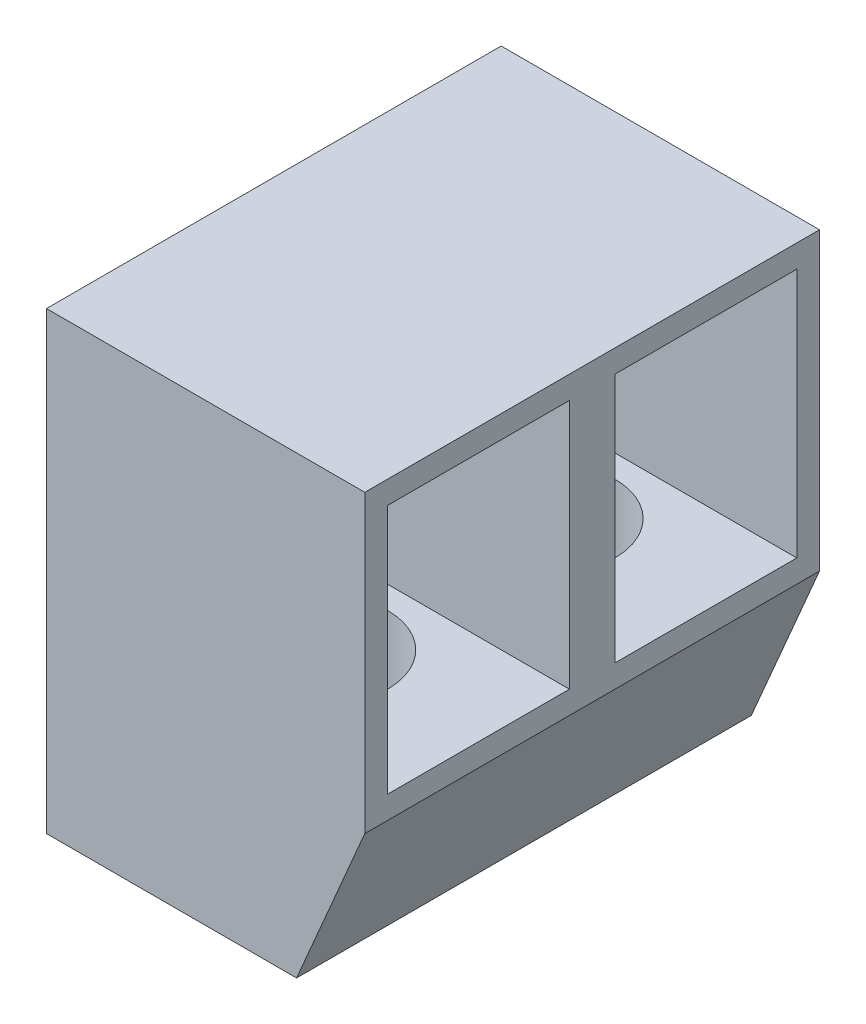
ISO-10303-21;
HEADER;
FILE_DESCRIPTION(('STEP AP214'),'2;1');
FILE_NAME('part.step','',(''),(''),'','','');
FILE_SCHEMA(('AUTOMOTIVE_DESIGN { 1 0 10303 214 1 1 1 1 }'));
ENDSEC;
DATA;
#1=APPLICATION_CONTEXT('core data for automotive mechanical design processes');
#2=APPLICATION_PROTOCOL_DEFINITION('international standard','automotive_design',2000,#1);
#3=PRODUCT_CONTEXT('',#1,'mechanical');
#4=PRODUCT('Part','Part','',(#3));
#5=PRODUCT_RELATED_PRODUCT_CATEGORY('part','',(#4));
#6=PRODUCT_DEFINITION_FORMATION('','',#4);
#7=PRODUCT_DEFINITION_CONTEXT('part definition',#1,'design');
#8=PRODUCT_DEFINITION('design','',#6,#7);
#9=PRODUCT_DEFINITION_SHAPE('','',#8);
#10=(LENGTH_UNIT() NAMED_UNIT(*) SI_UNIT(.MILLI.,.METRE.));
#11=(NAMED_UNIT(*) PLANE_ANGLE_UNIT() SI_UNIT($,.RADIAN.));
#12=(NAMED_UNIT(*) SI_UNIT($,.STERADIAN.) SOLID_ANGLE_UNIT());
#13=UNCERTAINTY_MEASURE_WITH_UNIT(LENGTH_MEASURE(1.E-05),#10,'distance_accuracy_value','');
#14=(GEOMETRIC_REPRESENTATION_CONTEXT(3) GLOBAL_UNCERTAINTY_ASSIGNED_CONTEXT((#13)) GLOBAL_UNIT_ASSIGNED_CONTEXT((#10,
#11,#12)) REPRESENTATION_CONTEXT('',''));
#15=CARTESIAN_POINT('',(0.,0.,0.));
#16=DIRECTION('',(0.,0.,1.));
#17=DIRECTION('',(1.,0.,0.));
#18=AXIS2_PLACEMENT_3D('',#15,#16,#17);
#19=CARTESIAN_POINT('',(5.5,0.,10.));
#20=DIRECTION('',(0.,1.,0.));
#21=DIRECTION('',(-1.,0.,0.));
#22=AXIS2_PLACEMENT_3D('',#19,#20,#21);
#23=PLANE('',#22);
#24=CARTESIAN_POINT('',(3.5,0.,7.5));
#25=DIRECTION('',(0.,1.,0.));
#26=DIRECTION('',(-1.,0.,0.));
#27=AXIS2_PLACEMENT_3D('',#24,#25,#26);
#28=CIRCLE('',#27,1.5);
#29=CARTESIAN_POINT('',(2.,0.,7.5));
#30=VERTEX_POINT('',#29);
#31=EDGE_CURVE('E257',#30,#30,#28,.F.);
#32=ORIENTED_EDGE('',*,*,#31,.F.);
#33=EDGE_LOOP('',(#32));
#34=FACE_BOUND('',#33,.T.);
#35=CARTESIAN_POINT('',(3.5,0.,2.5));
#36=DIRECTION('',(0.,1.,0.));
#37=DIRECTION('',(-1.,0.,0.));
#38=AXIS2_PLACEMENT_3D('',#35,#36,#37);
#39=CIRCLE('',#38,1.5);
#40=CARTESIAN_POINT('',(2.,0.,2.5));
#41=VERTEX_POINT('',#40);
#42=EDGE_CURVE('E260',#41,#41,#39,.F.);
#43=ORIENTED_EDGE('',*,*,#42,.F.);
#44=EDGE_LOOP('',(#43));
#45=FACE_BOUND('',#44,.T.);
#46=DIRECTION('',(1.,0.,0.));
#47=VECTOR('',#46,1.);
#48=CARTESIAN_POINT('',(5.5,0.,0.));
#49=LINE('',#48,#47);
#50=CARTESIAN_POINT('',(0.,0.,0.));
#51=VERTEX_POINT('',#50);
#52=CARTESIAN_POINT('',(5.5,0.,0.));
#53=VERTEX_POINT('',#52);
#54=EDGE_CURVE('E193',#51,#53,#49,.T.);
#55=ORIENTED_EDGE('',*,*,#54,.T.);
#56=DIRECTION('',(0.,0.,-1.));
#57=VECTOR('',#56,1.);
#58=CARTESIAN_POINT('',(5.5,0.,10.));
#59=LINE('',#58,#57);
#60=CARTESIAN_POINT('',(5.5,0.,10.));
#61=VERTEX_POINT('',#60);
#62=EDGE_CURVE('E11',#61,#53,#59,.T.);
#63=ORIENTED_EDGE('',*,*,#62,.F.);
#64=DIRECTION('',(1.,0.,0.));
#65=VECTOR('',#64,1.);
#66=CARTESIAN_POINT('',(5.5,0.,10.));
#67=LINE('',#66,#65);
#68=CARTESIAN_POINT('',(0.,0.,10.));
#69=VERTEX_POINT('',#68);
#70=EDGE_CURVE('E194',#69,#61,#67,.T.);
#71=ORIENTED_EDGE('',*,*,#70,.F.);
#72=DIRECTION('',(0.,0.,-1.));
#73=VECTOR('',#72,1.);
#74=CARTESIAN_POINT('',(0.,0.,10.));
#75=LINE('',#74,#73);
#76=EDGE_CURVE('E206',#69,#51,#75,.T.);
#77=ORIENTED_EDGE('',*,*,#76,.T.);
#78=EDGE_LOOP('',(#55,#63,#71,#77));
#79=FACE_BOUND('',#78,.T.);
#80=ADVANCED_FACE('F32',(#34,#45,#79),#23,.F.);
#81=CARTESIAN_POINT('',(7.,3.5,10.));
#82=DIRECTION('',(-0.919145030018058,0.393919298579168,0.));
#83=DIRECTION('',(-0.393919298579168,-0.919145030018058,0.));
#84=AXIS2_PLACEMENT_3D('',#81,#82,#83);
#85=PLANE('',#84);
#86=DIRECTION('',(0.393919298579168,0.919145030018058,0.));
#87=VECTOR('',#86,1.);
#88=CARTESIAN_POINT('',(7.,3.5,0.));
#89=LINE('',#88,#87);
#90=CARTESIAN_POINT('',(7.,3.5,0.));
#91=VERTEX_POINT('',#90);
#92=EDGE_CURVE('E209',#53,#91,#89,.T.);
#93=ORIENTED_EDGE('',*,*,#92,.T.);
#94=DIRECTION('',(0.,0.,-1.));
#95=VECTOR('',#94,1.);
#96=CARTESIAN_POINT('',(7.,3.5,10.));
#97=LINE('',#96,#95);
#98=CARTESIAN_POINT('',(7.,3.5,10.));
#99=VERTEX_POINT('',#98);
#100=EDGE_CURVE('E39',#99,#91,#97,.T.);
#101=ORIENTED_EDGE('',*,*,#100,.F.);
#102=DIRECTION('',(0.393919298579168,0.919145030018058,0.));
#103=VECTOR('',#102,1.);
#104=CARTESIAN_POINT('',(7.,3.5,10.));
#105=LINE('',#104,#103);
#106=EDGE_CURVE('E197',#61,#99,#105,.T.);
#107=ORIENTED_EDGE('',*,*,#106,.F.);
#108=ORIENTED_EDGE('',*,*,#62,.T.);
#109=EDGE_LOOP('',(#93,#101,#107,#108));
#110=FACE_BOUND('',#109,.T.);
#111=ADVANCED_FACE('F247',(#110),#85,.F.);
#112=CARTESIAN_POINT('',(7.,10.,10.));
#113=DIRECTION('',(-1.,0.,0.));
#114=DIRECTION('',(0.,-1.,0.));
#115=AXIS2_PLACEMENT_3D('',#112,#113,#114);
#116=PLANE('',#115);
#117=DIRECTION('',(0.,0.,-1.));
#118=VECTOR('',#117,1.);
#119=CARTESIAN_POINT('',(7.,4.,4.5));
#120=LINE('',#119,#118);
#121=CARTESIAN_POINT('',(7.,4.,4.5));
#122=VERTEX_POINT('',#121);
#123=CARTESIAN_POINT('',(7.,4.,0.5));
#124=VERTEX_POINT('',#123);
#125=EDGE_CURVE('E148',#122,#124,#120,.T.);
#126=ORIENTED_EDGE('',*,*,#125,.F.);
#127=DIRECTION('',(0.,-1.,0.));
#128=VECTOR('',#127,1.);
#129=CARTESIAN_POINT('',(7.,9.5,4.5));
#130=LINE('',#129,#128);
#131=CARTESIAN_POINT('',(7.,9.5,4.5));
#132=VERTEX_POINT('',#131);
#133=EDGE_CURVE('E46',#132,#122,#130,.T.);
#134=ORIENTED_EDGE('',*,*,#133,.F.);
#135=DIRECTION('',(0.,0.,1.));
#136=VECTOR('',#135,1.);
#137=CARTESIAN_POINT('',(7.,9.5,4.5));
#138=LINE('',#137,#136);
#139=CARTESIAN_POINT('',(7.,9.5,0.5));
#140=VERTEX_POINT('',#139);
#141=EDGE_CURVE('E134',#140,#132,#138,.T.);
#142=ORIENTED_EDGE('',*,*,#141,.F.);
#143=DIRECTION('',(0.,1.,0.));
#144=VECTOR('',#143,1.);
#145=CARTESIAN_POINT('',(7.,9.5,0.5));
#146=LINE('',#145,#144);
#147=EDGE_CURVE('E154',#124,#140,#146,.T.);
#148=ORIENTED_EDGE('',*,*,#147,.F.);
#149=EDGE_LOOP('',(#126,#134,#142,#148));
#150=FACE_BOUND('',#149,.T.);
#151=DIRECTION('',(0.,0.,-1.));
#152=VECTOR('',#151,1.);
#153=CARTESIAN_POINT('',(7.,4.,9.5));
#154=LINE('',#153,#152);
#155=CARTESIAN_POINT('',(7.,4.,9.5));
#156=VERTEX_POINT('',#155);
#157=CARTESIAN_POINT('',(7.,4.,5.5));
#158=VERTEX_POINT('',#157);
#159=EDGE_CURVE('E172',#156,#158,#154,.T.);
#160=ORIENTED_EDGE('',*,*,#159,.F.);
#161=DIRECTION('',(0.,-1.,0.));
#162=VECTOR('',#161,1.);
#163=CARTESIAN_POINT('',(7.,9.5,9.5));
#164=LINE('',#163,#162);
#165=CARTESIAN_POINT('',(7.,9.5,9.5));
#166=VERTEX_POINT('',#165);
#167=EDGE_CURVE('E170',#166,#156,#164,.T.);
#168=ORIENTED_EDGE('',*,*,#167,.F.);
#169=DIRECTION('',(0.,0.,1.));
#170=VECTOR('',#169,1.);
#171=CARTESIAN_POINT('',(7.,9.5,9.5));
#172=LINE('',#171,#170);
#173=CARTESIAN_POINT('',(7.,9.5,5.5));
#174=VERTEX_POINT('',#173);
#175=EDGE_CURVE('E178',#174,#166,#172,.T.);
#176=ORIENTED_EDGE('',*,*,#175,.F.);
#177=DIRECTION('',(0.,1.,0.));
#178=VECTOR('',#177,1.);
#179=CARTESIAN_POINT('',(7.,9.5,5.5));
#180=LINE('',#179,#178);
#181=EDGE_CURVE('E175',#158,#174,#180,.T.);
#182=ORIENTED_EDGE('',*,*,#181,.F.);
#183=EDGE_LOOP('',(#160,#168,#176,#182));
#184=FACE_BOUND('',#183,.T.);
#185=DIRECTION('',(0.,1.,0.));
#186=VECTOR('',#185,1.);
#187=CARTESIAN_POINT('',(7.,10.,0.));
#188=LINE('',#187,#186);
#189=CARTESIAN_POINT('',(7.,10.,0.));
#190=VERTEX_POINT('',#189);
#191=EDGE_CURVE('E211',#91,#190,#188,.T.);
#192=ORIENTED_EDGE('',*,*,#191,.T.);
#193=DIRECTION('',(0.,0.,-1.));
#194=VECTOR('',#193,1.);
#195=CARTESIAN_POINT('',(7.,10.,10.));
#196=LINE('',#195,#194);
#197=CARTESIAN_POINT('',(7.,10.,10.));
#198=VERTEX_POINT('',#197);
#199=EDGE_CURVE('E221',#198,#190,#196,.T.);
#200=ORIENTED_EDGE('',*,*,#199,.F.);
#201=DIRECTION('',(0.,1.,0.));
#202=VECTOR('',#201,1.);
#203=CARTESIAN_POINT('',(7.,10.,10.));
#204=LINE('',#203,#202);
#205=EDGE_CURVE('E200',#99,#198,#204,.T.);
#206=ORIENTED_EDGE('',*,*,#205,.F.);
#207=ORIENTED_EDGE('',*,*,#100,.T.);
#208=EDGE_LOOP('',(#192,#200,#206,#207));
#209=FACE_BOUND('',#208,.T.);
#210=ADVANCED_FACE('F228',(#150,#184,#209),#116,.F.);
#211=CARTESIAN_POINT('',(0.,10.,10.));
#212=DIRECTION('',(0.,-1.,0.));
#213=DIRECTION('',(0.,0.,-1.));
#214=AXIS2_PLACEMENT_3D('',#211,#212,#213);
#215=PLANE('',#214);
#216=DIRECTION('',(-1.,0.,0.));
#217=VECTOR('',#216,1.);
#218=CARTESIAN_POINT('',(0.,10.,0.));
#219=LINE('',#218,#217);
#220=CARTESIAN_POINT('',(0.,10.,0.));
#221=VERTEX_POINT('',#220);
#222=EDGE_CURVE('E213',#190,#221,#219,.T.);
#223=ORIENTED_EDGE('',*,*,#222,.T.);
#224=DIRECTION('',(0.,0.,-1.));
#225=VECTOR('',#224,1.);
#226=CARTESIAN_POINT('',(0.,10.,10.));
#227=LINE('',#226,#225);
#228=CARTESIAN_POINT('',(0.,10.,10.));
#229=VERTEX_POINT('',#228);
#230=EDGE_CURVE('E218',#229,#221,#227,.T.);
#231=ORIENTED_EDGE('',*,*,#230,.F.);
#232=DIRECTION('',(-1.,0.,0.));
#233=VECTOR('',#232,1.);
#234=CARTESIAN_POINT('',(0.,10.,10.));
#235=LINE('',#234,#233);
#236=EDGE_CURVE('E202',#198,#229,#235,.T.);
#237=ORIENTED_EDGE('',*,*,#236,.F.);
#238=ORIENTED_EDGE('',*,*,#199,.T.);
#239=EDGE_LOOP('',(#223,#231,#237,#238));
#240=FACE_BOUND('',#239,.T.);
#241=ADVANCED_FACE('F238',(#240),#215,.F.);
#242=CARTESIAN_POINT('',(0.,0.,10.));
#243=DIRECTION('',(1.,0.,0.));
#244=DIRECTION('',(0.,0.,-1.));
#245=AXIS2_PLACEMENT_3D('',#242,#243,#244);
#246=PLANE('',#245);
#247=DIRECTION('',(0.,0.,-1.));
#248=VECTOR('',#247,1.);
#249=CARTESIAN_POINT('',(0.,9.5,4.5));
#250=LINE('',#249,#248);
#251=CARTESIAN_POINT('',(0.,9.5,4.5));
#252=VERTEX_POINT('',#251);
#253=CARTESIAN_POINT('',(0.,9.5,0.5));
#254=VERTEX_POINT('',#253);
#255=EDGE_CURVE('E146',#252,#254,#250,.T.);
#256=ORIENTED_EDGE('',*,*,#255,.F.);
#257=DIRECTION('',(0.,1.,0.));
#258=VECTOR('',#257,1.);
#259=CARTESIAN_POINT('',(0.,9.5,4.5));
#260=LINE('',#259,#258);
#261=CARTESIAN_POINT('',(0.,4.,4.5));
#262=VERTEX_POINT('',#261);
#263=EDGE_CURVE('E128',#262,#252,#260,.T.);
#264=ORIENTED_EDGE('',*,*,#263,.F.);
#265=DIRECTION('',(0.,0.,1.));
#266=VECTOR('',#265,1.);
#267=CARTESIAN_POINT('',(0.,4.,4.5));
#268=LINE('',#267,#266);
#269=CARTESIAN_POINT('',(0.,4.,0.499999999999999));
#270=VERTEX_POINT('',#269);
#271=EDGE_CURVE('E137',#270,#262,#268,.T.);
#272=ORIENTED_EDGE('',*,*,#271,.F.);
#273=DIRECTION('',(0.,-1.,0.));
#274=VECTOR('',#273,1.);
#275=CARTESIAN_POINT('',(0.,9.5,0.5));
#276=LINE('',#275,#274);
#277=EDGE_CURVE('E54',#254,#270,#276,.T.);
#278=ORIENTED_EDGE('',*,*,#277,.F.);
#279=EDGE_LOOP('',(#256,#264,#272,#278));
#280=FACE_BOUND('',#279,.T.);
#281=DIRECTION('',(0.,0.,-1.));
#282=VECTOR('',#281,1.);
#283=CARTESIAN_POINT('',(0.,9.5,9.5));
#284=LINE('',#283,#282);
#285=CARTESIAN_POINT('',(0.,9.5,9.5));
#286=VERTEX_POINT('',#285);
#287=CARTESIAN_POINT('',(0.,9.5,5.5));
#288=VERTEX_POINT('',#287);
#289=EDGE_CURVE('E164',#286,#288,#284,.T.);
#290=ORIENTED_EDGE('',*,*,#289,.F.);
#291=DIRECTION('',(0.,1.,0.));
#292=VECTOR('',#291,1.);
#293=CARTESIAN_POINT('',(0.,9.5,9.5));
#294=LINE('',#293,#292);
#295=CARTESIAN_POINT('',(0.,4.,9.5));
#296=VERTEX_POINT('',#295);
#297=EDGE_CURVE('E167',#296,#286,#294,.T.);
#298=ORIENTED_EDGE('',*,*,#297,.F.);
#299=DIRECTION('',(0.,0.,1.));
#300=VECTOR('',#299,1.);
#301=CARTESIAN_POINT('',(0.,4.,9.5));
#302=LINE('',#301,#300);
#303=CARTESIAN_POINT('',(0.,4.,5.5));
#304=VERTEX_POINT('',#303);
#305=EDGE_CURVE('E184',#304,#296,#302,.T.);
#306=ORIENTED_EDGE('',*,*,#305,.F.);
#307=DIRECTION('',(0.,-1.,0.));
#308=VECTOR('',#307,1.);
#309=CARTESIAN_POINT('',(0.,9.5,5.5));
#310=LINE('',#309,#308);
#311=EDGE_CURVE('E140',#288,#304,#310,.T.);
#312=ORIENTED_EDGE('',*,*,#311,.F.);
#313=EDGE_LOOP('',(#290,#298,#306,#312));
#314=FACE_BOUND('',#313,.T.);
#315=DIRECTION('',(0.,-1.,0.));
#316=VECTOR('',#315,1.);
#317=CARTESIAN_POINT('',(0.,0.,0.));
#318=LINE('',#317,#316);
#319=EDGE_CURVE('E198',#221,#51,#318,.T.);
#320=ORIENTED_EDGE('',*,*,#319,.T.);
#321=ORIENTED_EDGE('',*,*,#76,.F.);
#322=DIRECTION('',(0.,-1.,0.));
#323=VECTOR('',#322,1.);
#324=CARTESIAN_POINT('',(0.,0.,10.));
#325=LINE('',#324,#323);
#326=EDGE_CURVE('E204',#229,#69,#325,.T.);
#327=ORIENTED_EDGE('',*,*,#326,.F.);
#328=ORIENTED_EDGE('',*,*,#230,.T.);
#329=EDGE_LOOP('',(#320,#321,#327,#328));
#330=FACE_BOUND('',#329,.T.);
#331=ADVANCED_FACE('F143',(#280,#314,#330),#246,.F.);
#332=CARTESIAN_POINT('',(0.,0.,10.));
#333=DIRECTION('',(0.,0.,-1.));
#334=DIRECTION('',(-1.,0.,0.));
#335=AXIS2_PLACEMENT_3D('',#332,#333,#334);
#336=PLANE('',#335);
#337=ORIENTED_EDGE('',*,*,#70,.T.);
#338=ORIENTED_EDGE('',*,*,#106,.T.);
#339=ORIENTED_EDGE('',*,*,#205,.T.);
#340=ORIENTED_EDGE('',*,*,#236,.T.);
#341=ORIENTED_EDGE('',*,*,#326,.T.);
#342=EDGE_LOOP('',(#337,#338,#339,#340,#341));
#343=FACE_BOUND('',#342,.T.);
#344=ADVANCED_FACE('F245',(#343),#336,.F.);
#345=CARTESIAN_POINT('',(0.,0.,0.));
#346=DIRECTION('',(0.,0.,-1.));
#347=DIRECTION('',(-1.,0.,0.));
#348=AXIS2_PLACEMENT_3D('',#345,#346,#347);
#349=PLANE('',#348);
#350=ORIENTED_EDGE('',*,*,#54,.F.);
#351=ORIENTED_EDGE('',*,*,#319,.F.);
#352=ORIENTED_EDGE('',*,*,#222,.F.);
#353=ORIENTED_EDGE('',*,*,#191,.F.);
#354=ORIENTED_EDGE('',*,*,#92,.F.);
#355=EDGE_LOOP('',(#350,#351,#352,#353,#354));
#356=FACE_BOUND('',#355,.T.);
#357=ADVANCED_FACE('F234',(#356),#349,.T.);
#358=CARTESIAN_POINT('',(-0.001000000000001,9.5,9.5));
#359=DIRECTION('',(0.,0.,1.));
#360=DIRECTION('',(1.,0.,0.));
#361=AXIS2_PLACEMENT_3D('',#358,#359,#360);
#362=PLANE('',#361);
#363=ORIENTED_EDGE('',*,*,#297,.T.);
#364=DIRECTION('',(1.,0.,0.));
#365=VECTOR('',#364,1.);
#366=CARTESIAN_POINT('',(-0.001000000000001,9.5,9.5));
#367=LINE('',#366,#365);
#368=EDGE_CURVE('E182',#286,#166,#367,.T.);
#369=ORIENTED_EDGE('',*,*,#368,.T.);
#370=ORIENTED_EDGE('',*,*,#167,.T.);
#371=DIRECTION('',(1.,0.,0.));
#372=VECTOR('',#371,1.);
#373=CARTESIAN_POINT('',(-0.001000000000001,4.,9.5));
#374=LINE('',#373,#372);
#375=EDGE_CURVE('E181',#296,#156,#374,.T.);
#376=ORIENTED_EDGE('',*,*,#375,.F.);
#377=EDGE_LOOP('',(#363,#369,#370,#376));
#378=FACE_BOUND('',#377,.T.);
#379=ADVANCED_FACE('F287',(#378),#362,.F.);
#380=CARTESIAN_POINT('',(-0.001000000000001,9.5,9.5));
#381=DIRECTION('',(0.,1.,0.));
#382=DIRECTION('',(-1.,0.,0.));
#383=AXIS2_PLACEMENT_3D('',#380,#381,#382);
#384=PLANE('',#383);
#385=ORIENTED_EDGE('',*,*,#289,.T.);
#386=DIRECTION('',(1.,0.,0.));
#387=VECTOR('',#386,1.);
#388=CARTESIAN_POINT('',(-0.001000000000001,9.5,5.5));
#389=LINE('',#388,#387);
#390=EDGE_CURVE('E185',#288,#174,#389,.T.);
#391=ORIENTED_EDGE('',*,*,#390,.T.);
#392=ORIENTED_EDGE('',*,*,#175,.T.);
#393=ORIENTED_EDGE('',*,*,#368,.F.);
#394=EDGE_LOOP('',(#385,#391,#392,#393));
#395=FACE_BOUND('',#394,.T.);
#396=ADVANCED_FACE('F294',(#395),#384,.F.);
#397=CARTESIAN_POINT('',(-0.001000000000001,9.5,5.5));
#398=DIRECTION('',(0.,0.,-1.));
#399=DIRECTION('',(-1.,0.,0.));
#400=AXIS2_PLACEMENT_3D('',#397,#398,#399);
#401=PLANE('',#400);
#402=ORIENTED_EDGE('',*,*,#311,.T.);
#403=DIRECTION('',(1.,0.,0.));
#404=VECTOR('',#403,1.);
#405=CARTESIAN_POINT('',(-0.001000000000001,4.,5.5));
#406=LINE('',#405,#404);
#407=EDGE_CURVE('E187',#304,#158,#406,.T.);
#408=ORIENTED_EDGE('',*,*,#407,.T.);
#409=ORIENTED_EDGE('',*,*,#181,.T.);
#410=ORIENTED_EDGE('',*,*,#390,.F.);
#411=EDGE_LOOP('',(#402,#408,#409,#410));
#412=FACE_BOUND('',#411,.T.);
#413=ADVANCED_FACE('F278',(#412),#401,.F.);
#414=CARTESIAN_POINT('',(-0.001000000000001,4.,9.5));
#415=DIRECTION('',(0.,-1.,0.));
#416=DIRECTION('',(1.,0.,0.));
#417=AXIS2_PLACEMENT_3D('',#414,#415,#416);
#418=PLANE('',#417);
#419=CARTESIAN_POINT('',(3.5,4.,7.5));
#420=DIRECTION('',(0.,1.,0.));
#421=DIRECTION('',(-1.,0.,0.));
#422=AXIS2_PLACEMENT_3D('',#419,#420,#421);
#423=CIRCLE('',#422,1.5);
#424=CARTESIAN_POINT('',(2.,4.,7.5));
#425=VERTEX_POINT('',#424);
#426=EDGE_CURVE('E268',#425,#425,#423,.T.);
#427=ORIENTED_EDGE('',*,*,#426,.F.);
#428=EDGE_LOOP('',(#427));
#429=FACE_BOUND('',#428,.T.);
#430=ORIENTED_EDGE('',*,*,#305,.T.);
#431=ORIENTED_EDGE('',*,*,#375,.T.);
#432=ORIENTED_EDGE('',*,*,#159,.T.);
#433=ORIENTED_EDGE('',*,*,#407,.F.);
#434=EDGE_LOOP('',(#430,#431,#432,#433));
#435=FACE_BOUND('',#434,.T.);
#436=ADVANCED_FACE('F275',(#429,#435),#418,.F.);
#437=CARTESIAN_POINT('',(-0.001000000000001,9.5,4.5));
#438=DIRECTION('',(0.,0.,1.));
#439=DIRECTION('',(1.,0.,0.));
#440=AXIS2_PLACEMENT_3D('',#437,#438,#439);
#441=PLANE('',#440);
#442=ORIENTED_EDGE('',*,*,#263,.T.);
#443=DIRECTION('',(1.,0.,0.));
#444=VECTOR('',#443,1.);
#445=CARTESIAN_POINT('',(-0.001000000000001,9.5,4.5));
#446=LINE('',#445,#444);
#447=EDGE_CURVE('E141',#252,#132,#446,.T.);
#448=ORIENTED_EDGE('',*,*,#447,.T.);
#449=ORIENTED_EDGE('',*,*,#133,.T.);
#450=DIRECTION('',(1.,0.,0.));
#451=VECTOR('',#450,1.);
#452=CARTESIAN_POINT('',(-0.001000000000001,4.,4.5));
#453=LINE('',#452,#451);
#454=EDGE_CURVE('E124',#262,#122,#453,.T.);
#455=ORIENTED_EDGE('',*,*,#454,.F.);
#456=EDGE_LOOP('',(#442,#448,#449,#455));
#457=FACE_BOUND('',#456,.T.);
#458=ADVANCED_FACE('F126',(#457),#441,.F.);
#459=CARTESIAN_POINT('',(-0.001000000000001,9.5,4.5));
#460=DIRECTION('',(0.,1.,0.));
#461=DIRECTION('',(-1.,0.,0.));
#462=AXIS2_PLACEMENT_3D('',#459,#460,#461);
#463=PLANE('',#462);
#464=ORIENTED_EDGE('',*,*,#255,.T.);
#465=DIRECTION('',(1.,0.,0.));
#466=VECTOR('',#465,1.);
#467=CARTESIAN_POINT('',(-0.001000000000001,9.5,0.5));
#468=LINE('',#467,#466);
#469=EDGE_CURVE('E160',#254,#140,#468,.T.);
#470=ORIENTED_EDGE('',*,*,#469,.T.);
#471=ORIENTED_EDGE('',*,*,#141,.T.);
#472=ORIENTED_EDGE('',*,*,#447,.F.);
#473=EDGE_LOOP('',(#464,#470,#471,#472));
#474=FACE_BOUND('',#473,.T.);
#475=ADVANCED_FACE('F322',(#474),#463,.F.);
#476=CARTESIAN_POINT('',(-0.001000000000001,9.5,0.5));
#477=DIRECTION('',(0.,0.,-1.));
#478=DIRECTION('',(-1.,0.,0.));
#479=AXIS2_PLACEMENT_3D('',#476,#477,#478);
#480=PLANE('',#479);
#481=ORIENTED_EDGE('',*,*,#277,.T.);
#482=DIRECTION('',(1.,0.,0.));
#483=VECTOR('',#482,1.);
#484=CARTESIAN_POINT('',(-0.001000000000001,4.,0.5));
#485=LINE('',#484,#483);
#486=EDGE_CURVE('E133',#270,#124,#485,.T.);
#487=ORIENTED_EDGE('',*,*,#486,.T.);
#488=ORIENTED_EDGE('',*,*,#147,.T.);
#489=ORIENTED_EDGE('',*,*,#469,.F.);
#490=EDGE_LOOP('',(#481,#487,#488,#489));
#491=FACE_BOUND('',#490,.T.);
#492=ADVANCED_FACE('F320',(#491),#480,.F.);
#493=CARTESIAN_POINT('',(-0.001000000000001,4.,4.5));
#494=DIRECTION('',(0.,-1.,0.));
#495=DIRECTION('',(1.,0.,0.));
#496=AXIS2_PLACEMENT_3D('',#493,#494,#495);
#497=PLANE('',#496);
#498=CARTESIAN_POINT('',(3.5,4.,2.5));
#499=DIRECTION('',(0.,1.,0.));
#500=DIRECTION('',(-1.,0.,0.));
#501=AXIS2_PLACEMENT_3D('',#498,#499,#500);
#502=CIRCLE('',#501,1.5);
#503=CARTESIAN_POINT('',(2.,4.,2.5));
#504=VERTEX_POINT('',#503);
#505=EDGE_CURVE('E262',#504,#504,#502,.T.);
#506=ORIENTED_EDGE('',*,*,#505,.F.);
#507=EDGE_LOOP('',(#506));
#508=FACE_BOUND('',#507,.T.);
#509=ORIENTED_EDGE('',*,*,#271,.T.);
#510=ORIENTED_EDGE('',*,*,#454,.T.);
#511=ORIENTED_EDGE('',*,*,#125,.T.);
#512=ORIENTED_EDGE('',*,*,#486,.F.);
#513=EDGE_LOOP('',(#509,#510,#511,#512));
#514=FACE_BOUND('',#513,.T.);
#515=ADVANCED_FACE('F138',(#508,#514),#497,.F.);
#516=CARTESIAN_POINT('',(3.5,-0.001000000000001,2.5));
#517=DIRECTION('',(0.,1.,0.));
#518=DIRECTION('',(-1.,0.,0.));
#519=AXIS2_PLACEMENT_3D('',#516,#517,#518);
#520=CYLINDRICAL_SURFACE('',#519,1.5);
#521=ORIENTED_EDGE('',*,*,#505,.T.);
#522=EDGE_LOOP('',(#521));
#523=FACE_BOUND('',#522,.T.);
#524=ORIENTED_EDGE('',*,*,#42,.T.);
#525=EDGE_LOOP('',(#524));
#526=FACE_BOUND('',#525,.T.);
#527=ADVANCED_FACE('F331',(#523,#526),#520,.F.);
#528=CARTESIAN_POINT('',(3.5,-0.001000000000001,7.5));
#529=DIRECTION('',(0.,1.,0.));
#530=DIRECTION('',(-1.,0.,0.));
#531=AXIS2_PLACEMENT_3D('',#528,#529,#530);
#532=CYLINDRICAL_SURFACE('',#531,1.5);
#533=ORIENTED_EDGE('',*,*,#426,.T.);
#534=EDGE_LOOP('',(#533));
#535=FACE_BOUND('',#534,.T.);
#536=ORIENTED_EDGE('',*,*,#31,.T.);
#537=EDGE_LOOP('',(#536));
#538=FACE_BOUND('',#537,.T.);
#539=ADVANCED_FACE('F272',(#535,#538),#532,.F.);
#540=CLOSED_SHELL('',(#80,#111,#210,#241,#331,#344,#357,#379,#396,#413,#436,#458,#475,#492,#515,
#527,#539));
#541=MANIFOLD_SOLID_BREP('B2',#540);
#542=ADVANCED_BREP_SHAPE_REPRESENTATION('',(#18,#541),#14);
#543=SHAPE_DEFINITION_REPRESENTATION(#9,#542);
ENDSEC;
END-ISO-10303-21;
